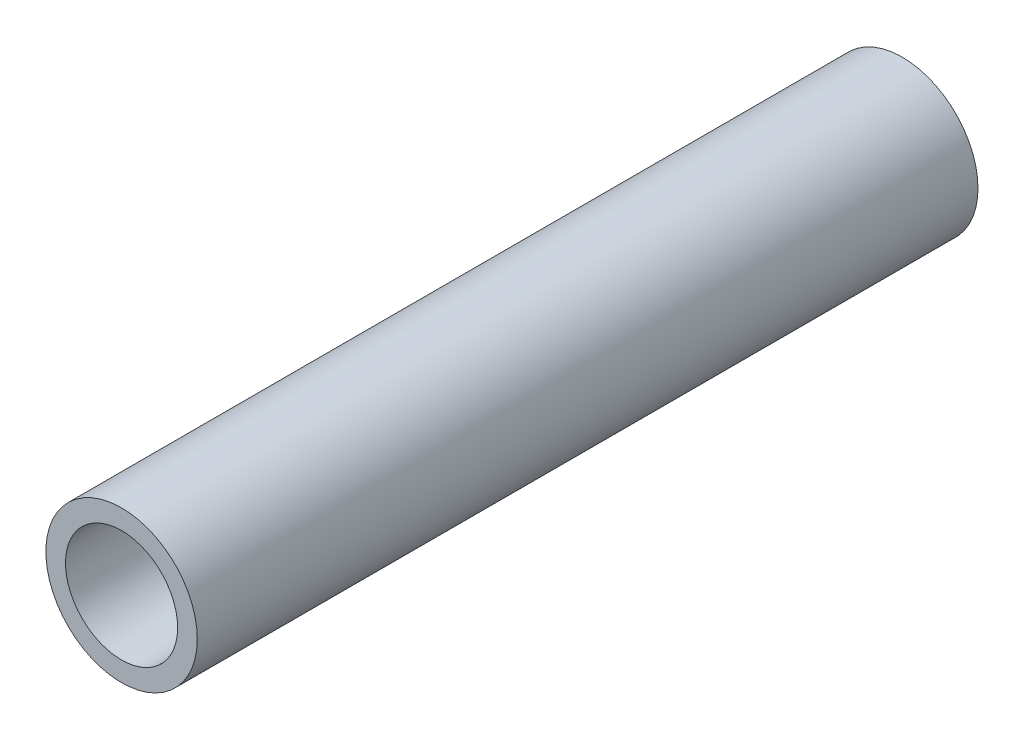
ISO-10303-21;
HEADER;
FILE_DESCRIPTION(('STEP AP214'),'2;1');
FILE_NAME('part.step','',(''),(''),'','','');
FILE_SCHEMA(('AUTOMOTIVE_DESIGN { 1 0 10303 214 1 1 1 1 }'));
ENDSEC;
DATA;
#1=APPLICATION_CONTEXT('core data for automotive mechanical design processes');
#2=APPLICATION_PROTOCOL_DEFINITION('international standard','automotive_design',2000,#1);
#3=PRODUCT_CONTEXT('',#1,'mechanical');
#4=PRODUCT('Part','Part','',(#3));
#5=PRODUCT_RELATED_PRODUCT_CATEGORY('part','',(#4));
#6=PRODUCT_DEFINITION_FORMATION('','',#4);
#7=PRODUCT_DEFINITION_CONTEXT('part definition',#1,'design');
#8=PRODUCT_DEFINITION('design','',#6,#7);
#9=PRODUCT_DEFINITION_SHAPE('','',#8);
#10=(LENGTH_UNIT() NAMED_UNIT(*) SI_UNIT(.MILLI.,.METRE.));
#11=(NAMED_UNIT(*) PLANE_ANGLE_UNIT() SI_UNIT($,.RADIAN.));
#12=(NAMED_UNIT(*) SI_UNIT($,.STERADIAN.) SOLID_ANGLE_UNIT());
#13=UNCERTAINTY_MEASURE_WITH_UNIT(LENGTH_MEASURE(1.E-05),#10,'distance_accuracy_value','');
#14=(GEOMETRIC_REPRESENTATION_CONTEXT(3) GLOBAL_UNCERTAINTY_ASSIGNED_CONTEXT((#13)) GLOBAL_UNIT_ASSIGNED_CONTEXT((#10,
#11,#12)) REPRESENTATION_CONTEXT('',''));
#15=CARTESIAN_POINT('',(0.,0.,0.));
#16=DIRECTION('',(0.,0.,1.));
#17=DIRECTION('',(1.,0.,0.));
#18=AXIS2_PLACEMENT_3D('',#15,#16,#17);
#19=CARTESIAN_POINT('',(0.,0.,55.));
#20=DIRECTION('',(0.,0.,1.));
#21=DIRECTION('',(1.,0.,0.));
#22=AXIS2_PLACEMENT_3D('',#19,#20,#21);
#23=PLANE('',#22);
#24=CARTESIAN_POINT('',(0.,0.,55.));
#25=DIRECTION('',(0.,0.,1.));
#26=DIRECTION('',(1.,0.,0.));
#27=AXIS2_PLACEMENT_3D('',#24,#25,#26);
#28=CIRCLE('',#27,10.668);
#29=CARTESIAN_POINT('',(10.668,0.,55.));
#30=VERTEX_POINT('',#29);
#31=EDGE_CURVE('E11',#30,#30,#28,.T.);
#32=ORIENTED_EDGE('',*,*,#31,.T.);
#33=EDGE_LOOP('',(#32));
#34=FACE_BOUND('',#33,.T.);
#35=CARTESIAN_POINT('',(0.,0.,55.));
#36=DIRECTION('',(0.,0.,1.));
#37=DIRECTION('',(1.,0.,0.));
#38=AXIS2_PLACEMENT_3D('',#35,#36,#37);
#39=CIRCLE('',#38,7.8994);
#40=CARTESIAN_POINT('',(7.8994,0.,55.));
#41=VERTEX_POINT('',#40);
#42=EDGE_CURVE('E48',#41,#41,#39,.T.);
#43=ORIENTED_EDGE('',*,*,#42,.F.);
#44=EDGE_LOOP('',(#43));
#45=FACE_BOUND('',#44,.T.);
#46=ADVANCED_FACE('F37',(#34,#45),#23,.T.);
#47=CARTESIAN_POINT('',(0.,0.,-55.));
#48=DIRECTION('',(0.,0.,1.));
#49=DIRECTION('',(1.,0.,0.));
#50=AXIS2_PLACEMENT_3D('',#47,#48,#49);
#51=PLANE('',#50);
#52=CARTESIAN_POINT('',(0.,0.,-55.));
#53=DIRECTION('',(0.,0.,1.));
#54=DIRECTION('',(1.,0.,0.));
#55=AXIS2_PLACEMENT_3D('',#52,#53,#54);
#56=CIRCLE('',#55,10.668);
#57=CARTESIAN_POINT('',(10.668,0.,-55.));
#58=VERTEX_POINT('',#57);
#59=EDGE_CURVE('E41',#58,#58,#56,.T.);
#60=ORIENTED_EDGE('',*,*,#59,.F.);
#61=EDGE_LOOP('',(#60));
#62=FACE_BOUND('',#61,.T.);
#63=CARTESIAN_POINT('',(0.,0.,-55.));
#64=DIRECTION('',(0.,0.,1.));
#65=DIRECTION('',(1.,0.,0.));
#66=AXIS2_PLACEMENT_3D('',#63,#64,#65);
#67=CIRCLE('',#66,7.8994);
#68=CARTESIAN_POINT('',(7.8994,0.,-55.));
#69=VERTEX_POINT('',#68);
#70=EDGE_CURVE('E50',#69,#69,#67,.T.);
#71=ORIENTED_EDGE('',*,*,#70,.T.);
#72=EDGE_LOOP('',(#71));
#73=FACE_BOUND('',#72,.T.);
#74=ADVANCED_FACE('F60',(#62,#73),#51,.F.);
#75=CARTESIAN_POINT('',(0.,0.,55.));
#76=DIRECTION('',(0.,0.,-1.));
#77=DIRECTION('',(-1.,0.,0.));
#78=AXIS2_PLACEMENT_3D('',#75,#76,#77);
#79=CYLINDRICAL_SURFACE('',#78,10.668);
#80=ORIENTED_EDGE('',*,*,#31,.F.);
#81=EDGE_LOOP('',(#80));
#82=FACE_BOUND('',#81,.T.);
#83=ORIENTED_EDGE('',*,*,#59,.T.);
#84=EDGE_LOOP('',(#83));
#85=FACE_BOUND('',#84,.T.);
#86=ADVANCED_FACE('F39',(#82,#85),#79,.T.);
#87=CARTESIAN_POINT('',(0.,0.,55.));
#88=DIRECTION('',(0.,0.,-1.));
#89=DIRECTION('',(-1.,0.,0.));
#90=AXIS2_PLACEMENT_3D('',#87,#88,#89);
#91=CYLINDRICAL_SURFACE('',#90,7.8994);
#92=ORIENTED_EDGE('',*,*,#42,.T.);
#93=EDGE_LOOP('',(#92));
#94=FACE_BOUND('',#93,.T.);
#95=ORIENTED_EDGE('',*,*,#70,.F.);
#96=EDGE_LOOP('',(#95));
#97=FACE_BOUND('',#96,.T.);
#98=ADVANCED_FACE('F56',(#94,#97),#91,.F.);
#99=CLOSED_SHELL('',(#46,#74,#86,#98));
#100=MANIFOLD_SOLID_BREP('B2',#99);
#101=ADVANCED_BREP_SHAPE_REPRESENTATION('',(#18,#100),#14);
#102=SHAPE_DEFINITION_REPRESENTATION(#9,#101);
ENDSEC;
END-ISO-10303-21;
